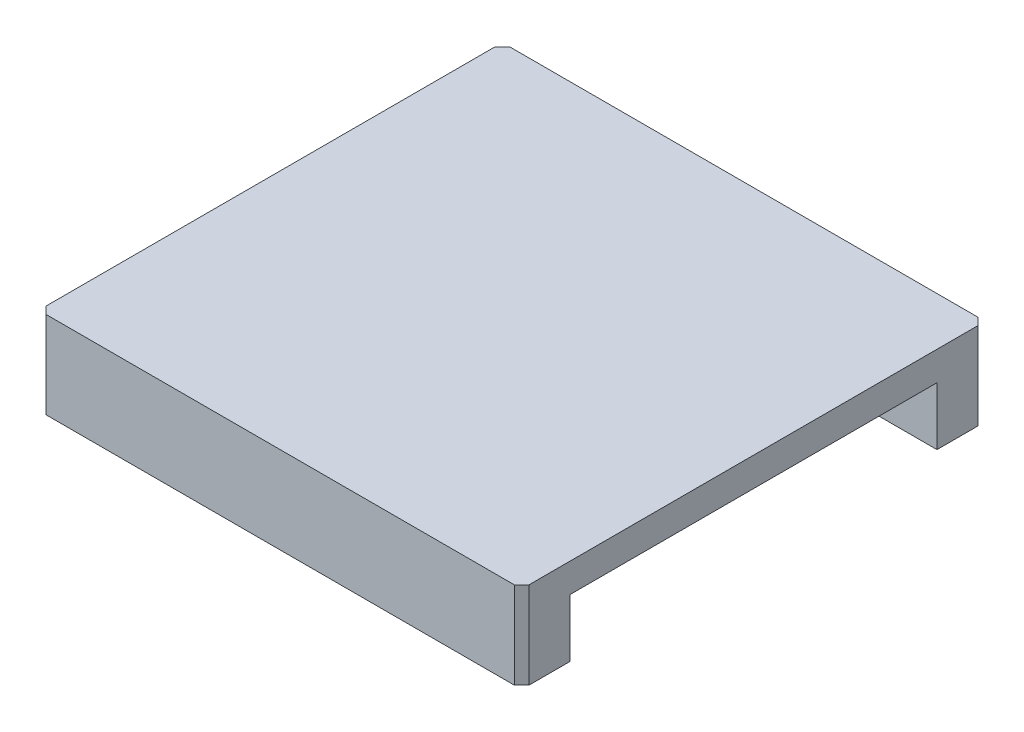
ISO-10303-21;
HEADER;
FILE_DESCRIPTION(('STEP AP214'),'2;1');
FILE_NAME('part.step','',(''),(''),'','','');
FILE_SCHEMA(('AUTOMOTIVE_DESIGN { 1 0 10303 214 1 1 1 1 }'));
ENDSEC;
DATA;
#1=APPLICATION_CONTEXT('core data for automotive mechanical design processes');
#2=APPLICATION_PROTOCOL_DEFINITION('international standard','automotive_design',2000,#1);
#3=PRODUCT_CONTEXT('',#1,'mechanical');
#4=PRODUCT('Part','Part','',(#3));
#5=PRODUCT_RELATED_PRODUCT_CATEGORY('part','',(#4));
#6=PRODUCT_DEFINITION_FORMATION('','',#4);
#7=PRODUCT_DEFINITION_CONTEXT('part definition',#1,'design');
#8=PRODUCT_DEFINITION('design','',#6,#7);
#9=PRODUCT_DEFINITION_SHAPE('','',#8);
#10=(LENGTH_UNIT() NAMED_UNIT(*) SI_UNIT(.MILLI.,.METRE.));
#11=(NAMED_UNIT(*) PLANE_ANGLE_UNIT() SI_UNIT($,.RADIAN.));
#12=(NAMED_UNIT(*) SI_UNIT($,.STERADIAN.) SOLID_ANGLE_UNIT());
#13=UNCERTAINTY_MEASURE_WITH_UNIT(LENGTH_MEASURE(1.E-05),#10,'distance_accuracy_value','');
#14=(GEOMETRIC_REPRESENTATION_CONTEXT(3) GLOBAL_UNCERTAINTY_ASSIGNED_CONTEXT((#13)) GLOBAL_UNIT_ASSIGNED_CONTEXT((#10,
#11,#12)) REPRESENTATION_CONTEXT('',''));
#15=CARTESIAN_POINT('',(0.,0.,0.));
#16=DIRECTION('',(0.,0.,1.));
#17=DIRECTION('',(1.,0.,0.));
#18=AXIS2_PLACEMENT_3D('',#15,#16,#17);
#19=CARTESIAN_POINT('',(50.,9.,0.));
#20=DIRECTION('',(0.,0.,-1.));
#21=DIRECTION('',(0.,1.,0.));
#22=AXIS2_PLACEMENT_3D('',#19,#20,#21);
#23=PLANE('',#22);
#24=DIRECTION('',(-1.,0.,0.));
#25=VECTOR('',#24,1.);
#26=CARTESIAN_POINT('',(50.,9.,0.));
#27=LINE('',#26,#25);
#28=CARTESIAN_POINT('',(49.25,9.,0.));
#29=VERTEX_POINT('',#28);
#30=CARTESIAN_POINT('',(0.749999999999994,9.,0.));
#31=VERTEX_POINT('',#30);
#32=EDGE_CURVE('E168',#29,#31,#27,.T.);
#33=ORIENTED_EDGE('',*,*,#32,.T.);
#34=DIRECTION('',(0.,-1.,0.));
#35=VECTOR('',#34,1.);
#36=CARTESIAN_POINT('',(0.749999999999994,9.,0.));
#37=LINE('',#36,#35);
#38=CARTESIAN_POINT('',(0.749999999999994,0.,0.));
#39=VERTEX_POINT('',#38);
#40=EDGE_CURVE('E197',#31,#39,#37,.T.);
#41=ORIENTED_EDGE('',*,*,#40,.T.);
#42=DIRECTION('',(-1.,0.,0.));
#43=VECTOR('',#42,1.);
#44=CARTESIAN_POINT('',(50.,0.,0.));
#45=LINE('',#44,#43);
#46=CARTESIAN_POINT('',(49.25,0.,0.));
#47=VERTEX_POINT('',#46);
#48=EDGE_CURVE('E152',#47,#39,#45,.T.);
#49=ORIENTED_EDGE('',*,*,#48,.F.);
#50=DIRECTION('',(0.,1.,0.));
#51=VECTOR('',#50,1.);
#52=CARTESIAN_POINT('',(49.25,9.,0.));
#53=LINE('',#52,#51);
#54=EDGE_CURVE('E195',#47,#29,#53,.T.);
#55=ORIENTED_EDGE('',*,*,#54,.T.);
#56=EDGE_LOOP('',(#33,#41,#49,#55));
#57=FACE_BOUND('',#56,.T.);
#58=ADVANCED_FACE('F41',(#57),#23,.F.);
#59=CARTESIAN_POINT('',(50.,0.,0.));
#60=DIRECTION('',(0.,1.,0.));
#61=DIRECTION('',(0.,0.,1.));
#62=AXIS2_PLACEMENT_3D('',#59,#60,#61);
#63=PLANE('',#62);
#64=ORIENTED_EDGE('',*,*,#48,.T.);
#65=DIRECTION('',(0.707106781186544,0.,0.707106781186551));
#66=VECTOR('',#65,1.);
#67=CARTESIAN_POINT('',(0.749999999999994,0.,0.));
#68=LINE('',#67,#66);
#69=CARTESIAN_POINT('',(0.,0.,-0.750000000000001));
#70=VERTEX_POINT('',#69);
#71=EDGE_CURVE('E202',#39,#70,#68,.F.);
#72=ORIENTED_EDGE('',*,*,#71,.T.);
#73=DIRECTION('',(0.,0.,-1.));
#74=VECTOR('',#73,1.);
#75=CARTESIAN_POINT('',(0.,0.,0.));
#76=LINE('',#75,#74);
#77=CARTESIAN_POINT('',(0.,0.,-5.));
#78=VERTEX_POINT('',#77);
#79=EDGE_CURVE('E149',#70,#78,#76,.T.);
#80=ORIENTED_EDGE('',*,*,#79,.T.);
#81=DIRECTION('',(-1.,0.,0.));
#82=VECTOR('',#81,1.);
#83=CARTESIAN_POINT('',(50.,0.,-5.));
#84=LINE('',#83,#82);
#85=CARTESIAN_POINT('',(50.,0.,-5.));
#86=VERTEX_POINT('',#85);
#87=EDGE_CURVE('E145',#86,#78,#84,.T.);
#88=ORIENTED_EDGE('',*,*,#87,.F.);
#89=DIRECTION('',(0.,0.,-1.));
#90=VECTOR('',#89,1.);
#91=CARTESIAN_POINT('',(50.,0.,0.));
#92=LINE('',#91,#90);
#93=CARTESIAN_POINT('',(50.,0.,-0.749999999999994));
#94=VERTEX_POINT('',#93);
#95=EDGE_CURVE('E133',#94,#86,#92,.T.);
#96=ORIENTED_EDGE('',*,*,#95,.F.);
#97=DIRECTION('',(-0.707106781186551,0.,0.707106781186544));
#98=VECTOR('',#97,1.);
#99=CARTESIAN_POINT('',(50.,0.,-0.749999999999994));
#100=LINE('',#99,#98);
#101=EDGE_CURVE('E200',#94,#47,#100,.T.);
#102=ORIENTED_EDGE('',*,*,#101,.T.);
#103=EDGE_LOOP('',(#64,#72,#80,#88,#96,#102));
#104=FACE_BOUND('',#103,.T.);
#105=ADVANCED_FACE('F147',(#104),#63,.F.);
#106=CARTESIAN_POINT('',(50.,0.,-5.));
#107=DIRECTION('',(0.,0.,1.));
#108=DIRECTION('',(1.,0.,0.));
#109=AXIS2_PLACEMENT_3D('',#106,#107,#108);
#110=PLANE('',#109);
#111=DIRECTION('',(0.,1.,0.));
#112=VECTOR('',#111,1.);
#113=CARTESIAN_POINT('',(0.,0.,-5.));
#114=LINE('',#113,#112);
#115=CARTESIAN_POINT('',(0.,6.,-5.));
#116=VERTEX_POINT('',#115);
#117=EDGE_CURVE('E170',#78,#116,#114,.T.);
#118=ORIENTED_EDGE('',*,*,#117,.T.);
#119=DIRECTION('',(-1.,0.,0.));
#120=VECTOR('',#119,1.);
#121=CARTESIAN_POINT('',(50.,6.,-5.));
#122=LINE('',#121,#120);
#123=CARTESIAN_POINT('',(50.,6.,-5.));
#124=VERTEX_POINT('',#123);
#125=EDGE_CURVE('E153',#124,#116,#122,.T.);
#126=ORIENTED_EDGE('',*,*,#125,.F.);
#127=DIRECTION('',(0.,1.,0.));
#128=VECTOR('',#127,1.);
#129=CARTESIAN_POINT('',(50.,0.,-5.));
#130=LINE('',#129,#128);
#131=EDGE_CURVE('E137',#86,#124,#130,.T.);
#132=ORIENTED_EDGE('',*,*,#131,.F.);
#133=ORIENTED_EDGE('',*,*,#87,.T.);
#134=EDGE_LOOP('',(#118,#126,#132,#133));
#135=FACE_BOUND('',#134,.T.);
#136=ADVANCED_FACE('F155',(#135),#110,.F.);
#137=CARTESIAN_POINT('',(50.,6.,-5.));
#138=DIRECTION('',(0.,1.,0.));
#139=DIRECTION('',(0.,0.,1.));
#140=AXIS2_PLACEMENT_3D('',#137,#138,#139);
#141=PLANE('',#140);
#142=DIRECTION('',(0.,0.,-1.));
#143=VECTOR('',#142,1.);
#144=CARTESIAN_POINT('',(0.,6.,-5.));
#145=LINE('',#144,#143);
#146=CARTESIAN_POINT('',(0.,6.,-43.));
#147=VERTEX_POINT('',#146);
#148=EDGE_CURVE('E172',#116,#147,#145,.T.);
#149=ORIENTED_EDGE('',*,*,#148,.T.);
#150=DIRECTION('',(-1.,0.,0.));
#151=VECTOR('',#150,1.);
#152=CARTESIAN_POINT('',(50.,6.,-43.));
#153=LINE('',#152,#151);
#154=CARTESIAN_POINT('',(50.,6.,-43.));
#155=VERTEX_POINT('',#154);
#156=EDGE_CURVE('E190',#155,#147,#153,.T.);
#157=ORIENTED_EDGE('',*,*,#156,.F.);
#158=DIRECTION('',(0.,0.,-1.));
#159=VECTOR('',#158,1.);
#160=CARTESIAN_POINT('',(50.,6.,-5.));
#161=LINE('',#160,#159);
#162=EDGE_CURVE('E158',#124,#155,#161,.T.);
#163=ORIENTED_EDGE('',*,*,#162,.F.);
#164=ORIENTED_EDGE('',*,*,#125,.T.);
#165=EDGE_LOOP('',(#149,#157,#163,#164));
#166=FACE_BOUND('',#165,.T.);
#167=ADVANCED_FACE('F276',(#166),#141,.F.);
#168=CARTESIAN_POINT('',(50.,6.,-43.));
#169=DIRECTION('',(0.,0.,-1.));
#170=DIRECTION('',(-1.,0.,0.));
#171=AXIS2_PLACEMENT_3D('',#168,#169,#170);
#172=PLANE('',#171);
#173=DIRECTION('',(0.,-1.,0.));
#174=VECTOR('',#173,1.);
#175=CARTESIAN_POINT('',(0.,6.,-43.));
#176=LINE('',#175,#174);
#177=CARTESIAN_POINT('',(0.,0.,-43.));
#178=VERTEX_POINT('',#177);
#179=EDGE_CURVE('E174',#147,#178,#176,.T.);
#180=ORIENTED_EDGE('',*,*,#179,.T.);
#181=DIRECTION('',(-1.,0.,0.));
#182=VECTOR('',#181,1.);
#183=CARTESIAN_POINT('',(50.,0.,-43.));
#184=LINE('',#183,#182);
#185=CARTESIAN_POINT('',(50.,0.,-43.));
#186=VERTEX_POINT('',#185);
#187=EDGE_CURVE('E187',#186,#178,#184,.T.);
#188=ORIENTED_EDGE('',*,*,#187,.F.);
#189=DIRECTION('',(0.,-1.,0.));
#190=VECTOR('',#189,1.);
#191=CARTESIAN_POINT('',(50.,6.,-43.));
#192=LINE('',#191,#190);
#193=EDGE_CURVE('E160',#155,#186,#192,.T.);
#194=ORIENTED_EDGE('',*,*,#193,.F.);
#195=ORIENTED_EDGE('',*,*,#156,.T.);
#196=EDGE_LOOP('',(#180,#188,#194,#195));
#197=FACE_BOUND('',#196,.T.);
#198=ADVANCED_FACE('F279',(#197),#172,.F.);
#199=CARTESIAN_POINT('',(50.,0.,-43.));
#200=DIRECTION('',(0.,1.,0.));
#201=DIRECTION('',(0.,0.,1.));
#202=AXIS2_PLACEMENT_3D('',#199,#200,#201);
#203=PLANE('',#202);
#204=DIRECTION('',(0.,0.,-1.));
#205=VECTOR('',#204,1.);
#206=CARTESIAN_POINT('',(0.,0.,-43.));
#207=LINE('',#206,#205);
#208=CARTESIAN_POINT('',(0.,0.,-47.25));
#209=VERTEX_POINT('',#208);
#210=EDGE_CURVE('E176',#178,#209,#207,.T.);
#211=ORIENTED_EDGE('',*,*,#210,.T.);
#212=DIRECTION('',(-0.707106781186544,0.,0.707106781186551));
#213=VECTOR('',#212,1.);
#214=CARTESIAN_POINT('',(0.749999999999994,0.,-48.));
#215=LINE('',#214,#213);
#216=CARTESIAN_POINT('',(0.749999999999994,0.,-48.));
#217=VERTEX_POINT('',#216);
#218=EDGE_CURVE('E63',#209,#217,#215,.F.);
#219=ORIENTED_EDGE('',*,*,#218,.T.);
#220=DIRECTION('',(-1.,0.,0.));
#221=VECTOR('',#220,1.);
#222=CARTESIAN_POINT('',(50.,0.,-48.));
#223=LINE('',#222,#221);
#224=CARTESIAN_POINT('',(49.25,0.,-48.));
#225=VERTEX_POINT('',#224);
#226=EDGE_CURVE('E185',#225,#217,#223,.T.);
#227=ORIENTED_EDGE('',*,*,#226,.F.);
#228=DIRECTION('',(0.707106781186544,0.,0.707106781186551));
#229=VECTOR('',#228,1.);
#230=CARTESIAN_POINT('',(50.,0.,-47.25));
#231=LINE('',#230,#229);
#232=CARTESIAN_POINT('',(50.,0.,-47.25));
#233=VERTEX_POINT('',#232);
#234=EDGE_CURVE('E57',#225,#233,#231,.T.);
#235=ORIENTED_EDGE('',*,*,#234,.T.);
#236=DIRECTION('',(0.,0.,-1.));
#237=VECTOR('',#236,1.);
#238=CARTESIAN_POINT('',(50.,0.,-43.));
#239=LINE('',#238,#237);
#240=EDGE_CURVE('E164',#186,#233,#239,.T.);
#241=ORIENTED_EDGE('',*,*,#240,.F.);
#242=ORIENTED_EDGE('',*,*,#187,.T.);
#243=EDGE_LOOP('',(#211,#219,#227,#235,#241,#242));
#244=FACE_BOUND('',#243,.T.);
#245=ADVANCED_FACE('F237',(#244),#203,.F.);
#246=CARTESIAN_POINT('',(50.,0.,-48.));
#247=DIRECTION('',(0.,0.,1.));
#248=DIRECTION('',(1.,0.,0.));
#249=AXIS2_PLACEMENT_3D('',#246,#247,#248);
#250=PLANE('',#249);
#251=ORIENTED_EDGE('',*,*,#226,.T.);
#252=DIRECTION('',(0.,1.,0.));
#253=VECTOR('',#252,1.);
#254=CARTESIAN_POINT('',(0.749999999999994,0.,-48.));
#255=LINE('',#254,#253);
#256=CARTESIAN_POINT('',(0.749999999999994,9.,-48.));
#257=VERTEX_POINT('',#256);
#258=EDGE_CURVE('E218',#217,#257,#255,.T.);
#259=ORIENTED_EDGE('',*,*,#258,.T.);
#260=DIRECTION('',(-1.,0.,0.));
#261=VECTOR('',#260,1.);
#262=CARTESIAN_POINT('',(50.,9.,-48.));
#263=LINE('',#262,#261);
#264=CARTESIAN_POINT('',(49.25,9.,-48.));
#265=VERTEX_POINT('',#264);
#266=EDGE_CURVE('E182',#265,#257,#263,.T.);
#267=ORIENTED_EDGE('',*,*,#266,.F.);
#268=DIRECTION('',(0.,-1.,0.));
#269=VECTOR('',#268,1.);
#270=CARTESIAN_POINT('',(49.25,0.,-48.));
#271=LINE('',#270,#269);
#272=EDGE_CURVE('E216',#265,#225,#271,.T.);
#273=ORIENTED_EDGE('',*,*,#272,.T.);
#274=EDGE_LOOP('',(#251,#259,#267,#273));
#275=FACE_BOUND('',#274,.T.);
#276=ADVANCED_FACE('F225',(#275),#250,.F.);
#277=CARTESIAN_POINT('',(50.,9.,-48.));
#278=DIRECTION('',(0.,-1.,0.));
#279=DIRECTION('',(0.,0.,-1.));
#280=AXIS2_PLACEMENT_3D('',#277,#278,#279);
#281=PLANE('',#280);
#282=DIRECTION('',(0.,0.,1.));
#283=VECTOR('',#282,1.);
#284=CARTESIAN_POINT('',(0.,9.,-48.));
#285=LINE('',#284,#283);
#286=CARTESIAN_POINT('',(0.,9.,-47.25));
#287=VERTEX_POINT('',#286);
#288=CARTESIAN_POINT('',(0.,9.,-0.750000000000001));
#289=VERTEX_POINT('',#288);
#290=EDGE_CURVE('E142',#287,#289,#285,.T.);
#291=ORIENTED_EDGE('',*,*,#290,.T.);
#292=DIRECTION('',(-0.707106781186544,0.,-0.707106781186551));
#293=VECTOR('',#292,1.);
#294=CARTESIAN_POINT('',(0.749999999999994,9.,0.));
#295=LINE('',#294,#293);
#296=EDGE_CURVE('E214',#289,#31,#295,.F.);
#297=ORIENTED_EDGE('',*,*,#296,.T.);
#298=ORIENTED_EDGE('',*,*,#32,.F.);
#299=DIRECTION('',(0.707106781186551,0.,-0.707106781186544));
#300=VECTOR('',#299,1.);
#301=CARTESIAN_POINT('',(50.,9.,-0.749999999999993));
#302=LINE('',#301,#300);
#303=CARTESIAN_POINT('',(50.,9.,-0.749999999999994));
#304=VERTEX_POINT('',#303);
#305=EDGE_CURVE('E208',#29,#304,#302,.T.);
#306=ORIENTED_EDGE('',*,*,#305,.T.);
#307=DIRECTION('',(0.,0.,1.));
#308=VECTOR('',#307,1.);
#309=CARTESIAN_POINT('',(50.,9.,-48.));
#310=LINE('',#309,#308);
#311=CARTESIAN_POINT('',(50.,9.,-47.25));
#312=VERTEX_POINT('',#311);
#313=EDGE_CURVE('E166',#312,#304,#310,.T.);
#314=ORIENTED_EDGE('',*,*,#313,.F.);
#315=DIRECTION('',(-0.707106781186544,0.,-0.707106781186551));
#316=VECTOR('',#315,1.);
#317=CARTESIAN_POINT('',(50.,9.,-47.25));
#318=LINE('',#317,#316);
#319=EDGE_CURVE('E210',#312,#265,#318,.T.);
#320=ORIENTED_EDGE('',*,*,#319,.T.);
#321=ORIENTED_EDGE('',*,*,#266,.T.);
#322=DIRECTION('',(0.707106781186544,0.,-0.707106781186551));
#323=VECTOR('',#322,1.);
#324=CARTESIAN_POINT('',(0.749999999999993,9.,-48.));
#325=LINE('',#324,#323);
#326=EDGE_CURVE('E212',#257,#287,#325,.F.);
#327=ORIENTED_EDGE('',*,*,#326,.T.);
#328=EDGE_LOOP('',(#291,#297,#298,#306,#314,#320,#321,#327));
#329=FACE_BOUND('',#328,.T.);
#330=ADVANCED_FACE('F229',(#329),#281,.F.);
#331=CARTESIAN_POINT('',(50.,0.,0.));
#332=DIRECTION('',(1.,0.,0.));
#333=DIRECTION('',(0.,0.,-1.));
#334=AXIS2_PLACEMENT_3D('',#331,#332,#333);
#335=PLANE('',#334);
#336=ORIENTED_EDGE('',*,*,#240,.T.);
#337=DIRECTION('',(0.,1.,0.));
#338=VECTOR('',#337,1.);
#339=CARTESIAN_POINT('',(50.,9.,-47.25));
#340=LINE('',#339,#338);
#341=EDGE_CURVE('E11',#233,#312,#340,.T.);
#342=ORIENTED_EDGE('',*,*,#341,.T.);
#343=ORIENTED_EDGE('',*,*,#313,.T.);
#344=DIRECTION('',(0.,-1.,0.));
#345=VECTOR('',#344,1.);
#346=CARTESIAN_POINT('',(50.,0.,-0.749999999999994));
#347=LINE('',#346,#345);
#348=EDGE_CURVE('E50',#304,#94,#347,.T.);
#349=ORIENTED_EDGE('',*,*,#348,.T.);
#350=ORIENTED_EDGE('',*,*,#95,.T.);
#351=ORIENTED_EDGE('',*,*,#131,.T.);
#352=ORIENTED_EDGE('',*,*,#162,.T.);
#353=ORIENTED_EDGE('',*,*,#193,.T.);
#354=EDGE_LOOP('',(#336,#342,#343,#349,#350,#351,#352,#353));
#355=FACE_BOUND('',#354,.T.);
#356=ADVANCED_FACE('F135',(#355),#335,.T.);
#357=CARTESIAN_POINT('',(0.,0.,0.));
#358=DIRECTION('',(1.,0.,0.));
#359=DIRECTION('',(0.,0.,-1.));
#360=AXIS2_PLACEMENT_3D('',#357,#358,#359);
#361=PLANE('',#360);
#362=ORIENTED_EDGE('',*,*,#79,.F.);
#363=DIRECTION('',(0.,1.,0.));
#364=VECTOR('',#363,1.);
#365=CARTESIAN_POINT('',(0.,0.,-0.750000000000001));
#366=LINE('',#365,#364);
#367=EDGE_CURVE('E206',#70,#289,#366,.T.);
#368=ORIENTED_EDGE('',*,*,#367,.T.);
#369=ORIENTED_EDGE('',*,*,#290,.F.);
#370=DIRECTION('',(0.,-1.,0.));
#371=VECTOR('',#370,1.);
#372=CARTESIAN_POINT('',(0.,0.,-47.25));
#373=LINE('',#372,#371);
#374=EDGE_CURVE('E204',#287,#209,#373,.T.);
#375=ORIENTED_EDGE('',*,*,#374,.T.);
#376=ORIENTED_EDGE('',*,*,#210,.F.);
#377=ORIENTED_EDGE('',*,*,#179,.F.);
#378=ORIENTED_EDGE('',*,*,#148,.F.);
#379=ORIENTED_EDGE('',*,*,#117,.F.);
#380=EDGE_LOOP('',(#362,#368,#369,#375,#376,#377,#378,#379));
#381=FACE_BOUND('',#380,.T.);
#382=ADVANCED_FACE('F242',(#381),#361,.F.);
#383=CARTESIAN_POINT('',(0.749999999999994,9.,0.));
#384=DIRECTION('',(0.707106781186551,0.,-0.707106781186544));
#385=DIRECTION('',(0.,-1.,0.));
#386=AXIS2_PLACEMENT_3D('',#383,#384,#385);
#387=PLANE('',#386);
#388=ORIENTED_EDGE('',*,*,#296,.F.);
#389=ORIENTED_EDGE('',*,*,#367,.F.);
#390=ORIENTED_EDGE('',*,*,#71,.F.);
#391=ORIENTED_EDGE('',*,*,#40,.F.);
#392=EDGE_LOOP('',(#388,#389,#390,#391));
#393=FACE_BOUND('',#392,.T.);
#394=ADVANCED_FACE('F247',(#393),#387,.F.);
#395=CARTESIAN_POINT('',(0.749999999999994,0.,-48.));
#396=DIRECTION('',(0.707106781186551,0.,0.707106781186544));
#397=DIRECTION('',(0.,1.,0.));
#398=AXIS2_PLACEMENT_3D('',#395,#396,#397);
#399=PLANE('',#398);
#400=ORIENTED_EDGE('',*,*,#218,.F.);
#401=ORIENTED_EDGE('',*,*,#374,.F.);
#402=ORIENTED_EDGE('',*,*,#326,.F.);
#403=ORIENTED_EDGE('',*,*,#258,.F.);
#404=EDGE_LOOP('',(#400,#401,#402,#403));
#405=FACE_BOUND('',#404,.T.);
#406=ADVANCED_FACE('F245',(#405),#399,.F.);
#407=CARTESIAN_POINT('',(50.,0.,-47.25));
#408=DIRECTION('',(0.707106781186551,0.,-0.707106781186544));
#409=DIRECTION('',(0.,-1.,0.));
#410=AXIS2_PLACEMENT_3D('',#407,#408,#409);
#411=PLANE('',#410);
#412=ORIENTED_EDGE('',*,*,#234,.F.);
#413=ORIENTED_EDGE('',*,*,#272,.F.);
#414=ORIENTED_EDGE('',*,*,#319,.F.);
#415=ORIENTED_EDGE('',*,*,#341,.F.);
#416=EDGE_LOOP('',(#412,#413,#414,#415));
#417=FACE_BOUND('',#416,.T.);
#418=ADVANCED_FACE('F234',(#417),#411,.T.);
#419=CARTESIAN_POINT('',(50.,0.,-0.749999999999994));
#420=DIRECTION('',(0.707106781186544,0.,0.707106781186551));
#421=DIRECTION('',(0.,1.,0.));
#422=AXIS2_PLACEMENT_3D('',#419,#420,#421);
#423=PLANE('',#422);
#424=ORIENTED_EDGE('',*,*,#305,.F.);
#425=ORIENTED_EDGE('',*,*,#54,.F.);
#426=ORIENTED_EDGE('',*,*,#101,.F.);
#427=ORIENTED_EDGE('',*,*,#348,.F.);
#428=EDGE_LOOP('',(#424,#425,#426,#427));
#429=FACE_BOUND('',#428,.T.);
#430=ADVANCED_FACE('F44',(#429),#423,.T.);
#431=CLOSED_SHELL('',(#58,#105,#136,#167,#198,#245,#276,#330,#356,#382,#394,#406,#418,#430));
#432=MANIFOLD_SOLID_BREP('B2',#431);
#433=ADVANCED_BREP_SHAPE_REPRESENTATION('',(#18,#432),#14);
#434=SHAPE_DEFINITION_REPRESENTATION(#9,#433);
ENDSEC;
END-ISO-10303-21;
